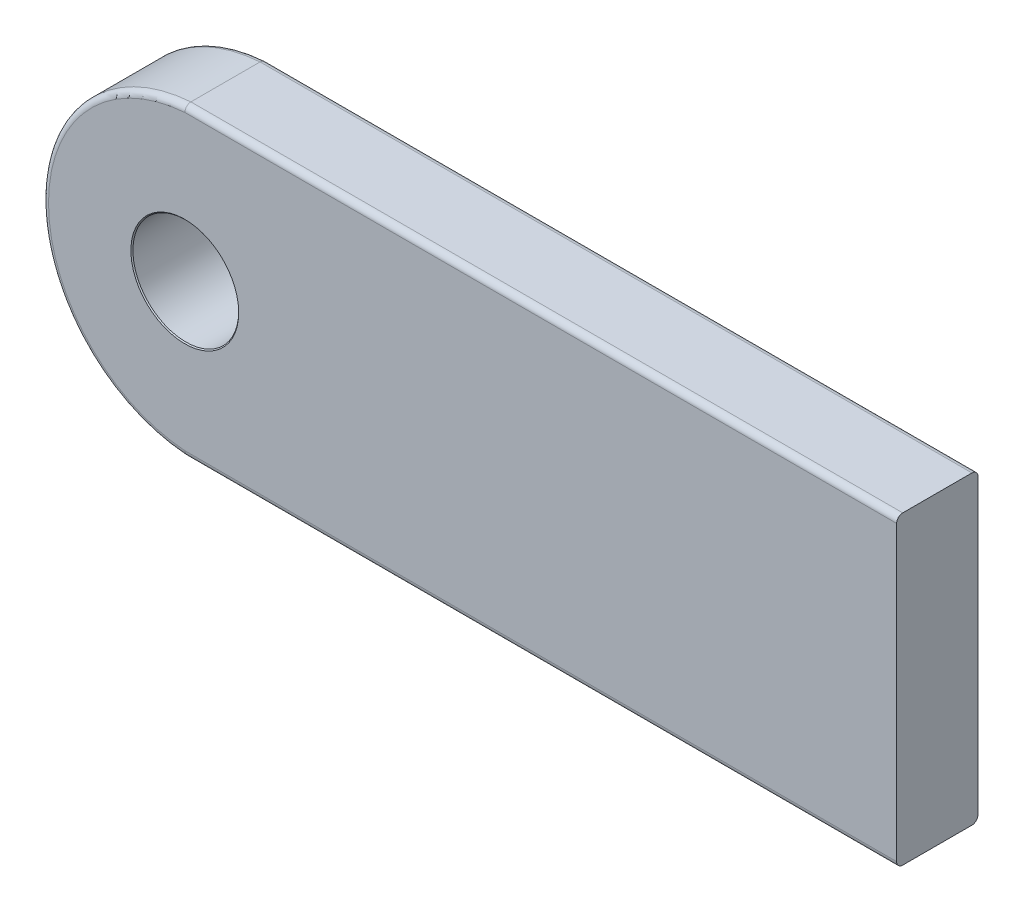
ISO-10303-21;
HEADER;
FILE_DESCRIPTION(('STEP AP214'),'2;1');
FILE_NAME('part.step','',(''),(''),'','','');
FILE_SCHEMA(('AUTOMOTIVE_DESIGN { 1 0 10303 214 1 1 1 1 }'));
ENDSEC;
DATA;
#1=APPLICATION_CONTEXT('core data for automotive mechanical design processes');
#2=APPLICATION_PROTOCOL_DEFINITION('international standard','automotive_design',2000,#1);
#3=PRODUCT_CONTEXT('',#1,'mechanical');
#4=PRODUCT('Part','Part','',(#3));
#5=PRODUCT_RELATED_PRODUCT_CATEGORY('part','',(#4));
#6=PRODUCT_DEFINITION_FORMATION('','',#4);
#7=PRODUCT_DEFINITION_CONTEXT('part definition',#1,'design');
#8=PRODUCT_DEFINITION('design','',#6,#7);
#9=PRODUCT_DEFINITION_SHAPE('','',#8);
#10=(LENGTH_UNIT() NAMED_UNIT(*) SI_UNIT(.MILLI.,.METRE.));
#11=(NAMED_UNIT(*) PLANE_ANGLE_UNIT() SI_UNIT($,.RADIAN.));
#12=(NAMED_UNIT(*) SI_UNIT($,.STERADIAN.) SOLID_ANGLE_UNIT());
#13=UNCERTAINTY_MEASURE_WITH_UNIT(LENGTH_MEASURE(1.E-05),#10,'distance_accuracy_value','');
#14=(GEOMETRIC_REPRESENTATION_CONTEXT(3) GLOBAL_UNCERTAINTY_ASSIGNED_CONTEXT((#13)) GLOBAL_UNIT_ASSIGNED_CONTEXT((#10,
#11,#12)) REPRESENTATION_CONTEXT('',''));
#15=CARTESIAN_POINT('',(0.,0.,0.));
#16=DIRECTION('',(0.,0.,1.));
#17=DIRECTION('',(1.,0.,0.));
#18=AXIS2_PLACEMENT_3D('',#15,#16,#17);
#19=CARTESIAN_POINT('',(-235.347698396897,0.,20.));
#20=DIRECTION('',(0.,0.,-1.));
#21=DIRECTION('',(-1.,0.,0.));
#22=AXIS2_PLACEMENT_3D('',#19,#20,#21);
#23=CYLINDRICAL_SURFACE('',#22,75.1785714285714);
#24=DIRECTION('',(0.,0.,-1.));
#25=VECTOR('',#24,1.);
#26=CARTESIAN_POINT('',(-240.526269825468,75.,20.));
#27=LINE('',#26,#25);
#28=CARTESIAN_POINT('',(-240.526269825468,75.,17.));
#29=VERTEX_POINT('',#28);
#30=CARTESIAN_POINT('',(-240.526269825468,75.,-17.));
#31=VERTEX_POINT('',#30);
#32=EDGE_CURVE('E271',#29,#31,#27,.T.);
#33=ORIENTED_EDGE('',*,*,#32,.T.);
#34=CARTESIAN_POINT('',(-235.347698396897,0.,-17.));
#35=DIRECTION('',(0.,0.,1.));
#36=DIRECTION('',(1.,0.,0.));
#37=AXIS2_PLACEMENT_3D('',#34,#35,#36);
#38=CIRCLE('',#37,75.1785714285714);
#39=CARTESIAN_POINT('',(-240.526269825468,-75.,-17.));
#40=VERTEX_POINT('',#39);
#41=EDGE_CURVE('E140',#31,#40,#38,.T.);
#42=ORIENTED_EDGE('',*,*,#41,.T.);
#43=DIRECTION('',(0.,0.,-1.));
#44=VECTOR('',#43,1.);
#45=CARTESIAN_POINT('',(-240.526269825468,-75.,20.));
#46=LINE('',#45,#44);
#47=CARTESIAN_POINT('',(-240.526269825468,-75.,17.));
#48=VERTEX_POINT('',#47);
#49=EDGE_CURVE('E118',#48,#40,#46,.T.);
#50=ORIENTED_EDGE('',*,*,#49,.F.);
#51=CARTESIAN_POINT('',(-235.347698396897,0.,17.));
#52=DIRECTION('',(0.,0.,1.));
#53=DIRECTION('',(1.,0.,0.));
#54=AXIS2_PLACEMENT_3D('',#51,#52,#53);
#55=CIRCLE('',#54,75.1785714285714);
#56=EDGE_CURVE('E138',#48,#29,#55,.F.);
#57=ORIENTED_EDGE('',*,*,#56,.T.);
#58=EDGE_LOOP('',(#33,#42,#50,#57));
#59=FACE_BOUND('',#58,.T.);
#60=ADVANCED_FACE('F33',(#59),#23,.T.);
#61=CARTESIAN_POINT('',(-240.526269825468,-75.,20.));
#62=DIRECTION('',(0.,1.,0.));
#63=DIRECTION('',(-1.,0.,0.));
#64=AXIS2_PLACEMENT_3D('',#61,#62,#63);
#65=PLANE('',#64);
#66=ORIENTED_EDGE('',*,*,#49,.T.);
#67=DIRECTION('',(1.,0.,0.));
#68=VECTOR('',#67,1.);
#69=CARTESIAN_POINT('',(-240.526269825468,-75.,-17.));
#70=LINE('',#69,#68);
#71=CARTESIAN_POINT('',(109.473730174532,-75.,-17.));
#72=VERTEX_POINT('',#71);
#73=EDGE_CURVE('E117',#40,#72,#70,.T.);
#74=ORIENTED_EDGE('',*,*,#73,.T.);
#75=DIRECTION('',(0.,0.,-1.));
#76=VECTOR('',#75,1.);
#77=CARTESIAN_POINT('',(109.473730174532,-75.,20.));
#78=LINE('',#77,#76);
#79=CARTESIAN_POINT('',(109.473730174532,-75.,17.));
#80=VERTEX_POINT('',#79);
#81=EDGE_CURVE('E102',#80,#72,#78,.T.);
#82=ORIENTED_EDGE('',*,*,#81,.F.);
#83=DIRECTION('',(1.,0.,0.));
#84=VECTOR('',#83,1.);
#85=CARTESIAN_POINT('',(-240.526269825468,-75.,17.));
#86=LINE('',#85,#84);
#87=EDGE_CURVE('E114',#80,#48,#86,.F.);
#88=ORIENTED_EDGE('',*,*,#87,.T.);
#89=EDGE_LOOP('',(#66,#74,#82,#88));
#90=FACE_BOUND('',#89,.T.);
#91=ADVANCED_FACE('F113',(#90),#65,.F.);
#92=CARTESIAN_POINT('',(109.473730174532,75.,20.));
#93=DIRECTION('',(1.,0.,0.));
#94=DIRECTION('',(0.,1.,0.));
#95=AXIS2_PLACEMENT_3D('',#92,#93,#94);
#96=PLANE('',#95);
#97=ORIENTED_EDGE('',*,*,#81,.T.);
#98=CARTESIAN_POINT('',(109.473730174532,-72.,-17.));
#99=DIRECTION('',(1.,0.,0.));
#100=DIRECTION('',(0.,1.,0.));
#101=AXIS2_PLACEMENT_3D('',#98,#99,#100);
#102=CIRCLE('',#101,3.);
#103=CARTESIAN_POINT('',(109.473730174532,-72.,-20.));
#104=VERTEX_POINT('',#103);
#105=EDGE_CURVE('E130',#72,#104,#102,.T.);
#106=ORIENTED_EDGE('',*,*,#105,.T.);
#107=DIRECTION('',(0.,-1.,0.));
#108=VECTOR('',#107,1.);
#109=CARTESIAN_POINT('',(109.473730174532,75.,-20.));
#110=LINE('',#109,#108);
#111=CARTESIAN_POINT('',(109.473730174532,72.,-20.));
#112=VERTEX_POINT('',#111);
#113=EDGE_CURVE('E254',#112,#104,#110,.T.);
#114=ORIENTED_EDGE('',*,*,#113,.F.);
#115=CARTESIAN_POINT('',(109.473730174532,72.,-17.));
#116=DIRECTION('',(1.,0.,0.));
#117=DIRECTION('',(0.,1.,0.));
#118=AXIS2_PLACEMENT_3D('',#115,#116,#117);
#119=CIRCLE('',#118,3.);
#120=CARTESIAN_POINT('',(109.473730174532,75.,-17.));
#121=VERTEX_POINT('',#120);
#122=EDGE_CURVE('E107',#112,#121,#119,.T.);
#123=ORIENTED_EDGE('',*,*,#122,.T.);
#124=DIRECTION('',(0.,0.,-1.));
#125=VECTOR('',#124,1.);
#126=CARTESIAN_POINT('',(109.473730174532,75.,20.));
#127=LINE('',#126,#125);
#128=CARTESIAN_POINT('',(109.473730174532,75.,17.));
#129=VERTEX_POINT('',#128);
#130=EDGE_CURVE('E119',#129,#121,#127,.T.);
#131=ORIENTED_EDGE('',*,*,#130,.F.);
#132=CARTESIAN_POINT('',(109.473730174532,72.,17.));
#133=DIRECTION('',(1.,0.,0.));
#134=DIRECTION('',(0.,1.,0.));
#135=AXIS2_PLACEMENT_3D('',#132,#133,#134);
#136=CIRCLE('',#135,3.);
#137=CARTESIAN_POINT('',(109.473730174532,72.,20.));
#138=VERTEX_POINT('',#137);
#139=EDGE_CURVE('E108',#129,#138,#136,.T.);
#140=ORIENTED_EDGE('',*,*,#139,.T.);
#141=DIRECTION('',(0.,-1.,0.));
#142=VECTOR('',#141,1.);
#143=CARTESIAN_POINT('',(109.473730174532,-39.9999999999999,20.));
#144=LINE('',#143,#142);
#145=CARTESIAN_POINT('',(109.473730174532,-72.,20.));
#146=VERTEX_POINT('',#145);
#147=EDGE_CURVE('E103',#138,#146,#144,.T.);
#148=ORIENTED_EDGE('',*,*,#147,.T.);
#149=CARTESIAN_POINT('',(109.473730174532,-72.,17.));
#150=DIRECTION('',(1.,0.,0.));
#151=DIRECTION('',(0.,1.,0.));
#152=AXIS2_PLACEMENT_3D('',#149,#150,#151);
#153=CIRCLE('',#152,3.);
#154=EDGE_CURVE('E99',#146,#80,#153,.T.);
#155=ORIENTED_EDGE('',*,*,#154,.T.);
#156=EDGE_LOOP('',(#97,#106,#114,#123,#131,#140,#148,#155));
#157=FACE_BOUND('',#156,.T.);
#158=ADVANCED_FACE('F101',(#157),#96,.T.);
#159=CARTESIAN_POINT('',(-240.526269825468,75.,20.));
#160=DIRECTION('',(0.,1.,0.));
#161=DIRECTION('',(-1.,0.,0.));
#162=AXIS2_PLACEMENT_3D('',#159,#160,#161);
#163=PLANE('',#162);
#164=ORIENTED_EDGE('',*,*,#130,.T.);
#165=DIRECTION('',(1.,0.,0.));
#166=VECTOR('',#165,1.);
#167=CARTESIAN_POINT('',(-240.526269825468,75.,-17.));
#168=LINE('',#167,#166);
#169=EDGE_CURVE('E144',#121,#31,#168,.F.);
#170=ORIENTED_EDGE('',*,*,#169,.T.);
#171=ORIENTED_EDGE('',*,*,#32,.F.);
#172=DIRECTION('',(1.,0.,0.));
#173=VECTOR('',#172,1.);
#174=CARTESIAN_POINT('',(-240.526269825468,75.,17.));
#175=LINE('',#174,#173);
#176=EDGE_CURVE('E142',#29,#129,#175,.T.);
#177=ORIENTED_EDGE('',*,*,#176,.T.);
#178=EDGE_LOOP('',(#164,#170,#171,#177));
#179=FACE_BOUND('',#178,.T.);
#180=ADVANCED_FACE('F226',(#179),#163,.T.);
#181=CARTESIAN_POINT('',(-235.347698396897,0.,20.));
#182=DIRECTION('',(0.,0.,1.));
#183=DIRECTION('',(1.,0.,0.));
#184=AXIS2_PLACEMENT_3D('',#181,#182,#183);
#185=PLANE('',#184);
#186=CARTESIAN_POINT('',(-240.526269825468,0.,20.));
#187=DIRECTION('',(0.,0.,1.));
#188=DIRECTION('',(1.,0.,0.));
#189=AXIS2_PLACEMENT_3D('',#186,#187,#188);
#190=CIRCLE('',#189,26.5000000000001);
#191=CARTESIAN_POINT('',(-214.026269825468,0.,20.));
#192=VERTEX_POINT('',#191);
#193=EDGE_CURVE('E41',#192,#192,#190,.F.);
#194=ORIENTED_EDGE('',*,*,#193,.T.);
#195=EDGE_LOOP('',(#194));
#196=FACE_BOUND('',#195,.T.);
#197=CARTESIAN_POINT('',(-235.347698396897,0.,20.));
#198=DIRECTION('',(0.,0.,1.));
#199=DIRECTION('',(1.,0.,0.));
#200=AXIS2_PLACEMENT_3D('',#197,#198,#199);
#201=CIRCLE('',#200,72.1785714285714);
#202=CARTESIAN_POINT('',(-240.42176712617,72.,20.));
#203=VERTEX_POINT('',#202);
#204=CARTESIAN_POINT('',(-240.42176712617,-72.,20.));
#205=VERTEX_POINT('',#204);
#206=EDGE_CURVE('E48',#203,#205,#201,.T.);
#207=ORIENTED_EDGE('',*,*,#206,.T.);
#208=DIRECTION('',(1.,0.,0.));
#209=VECTOR('',#208,1.);
#210=CARTESIAN_POINT('',(109.473730174532,-72.,20.));
#211=LINE('',#210,#209);
#212=EDGE_CURVE('E148',#205,#146,#211,.T.);
#213=ORIENTED_EDGE('',*,*,#212,.T.);
#214=ORIENTED_EDGE('',*,*,#147,.F.);
#215=DIRECTION('',(1.,0.,0.));
#216=VECTOR('',#215,1.);
#217=CARTESIAN_POINT('',(-235.347698396897,72.,20.));
#218=LINE('',#217,#216);
#219=EDGE_CURVE('E53',#138,#203,#218,.F.);
#220=ORIENTED_EDGE('',*,*,#219,.T.);
#221=EDGE_LOOP('',(#207,#213,#214,#220));
#222=FACE_BOUND('',#221,.T.);
#223=ADVANCED_FACE('F229',(#196,#222),#185,.T.);
#224=CARTESIAN_POINT('',(-235.347698396897,0.,-20.));
#225=DIRECTION('',(0.,0.,1.));
#226=DIRECTION('',(1.,0.,0.));
#227=AXIS2_PLACEMENT_3D('',#224,#225,#226);
#228=PLANE('',#227);
#229=CARTESIAN_POINT('',(-240.526269825468,0.,-20.));
#230=DIRECTION('',(0.,0.,1.));
#231=DIRECTION('',(1.,0.,0.));
#232=AXIS2_PLACEMENT_3D('',#229,#230,#231);
#233=CIRCLE('',#232,26.5);
#234=CARTESIAN_POINT('',(-214.026269825468,0.,-20.));
#235=VERTEX_POINT('',#234);
#236=EDGE_CURVE('E11',#235,#235,#233,.T.);
#237=ORIENTED_EDGE('',*,*,#236,.T.);
#238=EDGE_LOOP('',(#237));
#239=FACE_BOUND('',#238,.T.);
#240=ORIENTED_EDGE('',*,*,#113,.T.);
#241=DIRECTION('',(1.,0.,0.));
#242=VECTOR('',#241,1.);
#243=CARTESIAN_POINT('',(-235.347698396897,-72.,-20.));
#244=LINE('',#243,#242);
#245=CARTESIAN_POINT('',(-240.42176712617,-72.,-20.));
#246=VERTEX_POINT('',#245);
#247=EDGE_CURVE('E136',#104,#246,#244,.F.);
#248=ORIENTED_EDGE('',*,*,#247,.T.);
#249=CARTESIAN_POINT('',(-235.347698396897,0.,-20.));
#250=DIRECTION('',(0.,0.,1.));
#251=DIRECTION('',(1.,0.,0.));
#252=AXIS2_PLACEMENT_3D('',#249,#250,#251);
#253=CIRCLE('',#252,72.1785714285714);
#254=CARTESIAN_POINT('',(-240.42176712617,72.,-20.));
#255=VERTEX_POINT('',#254);
#256=EDGE_CURVE('E134',#246,#255,#253,.F.);
#257=ORIENTED_EDGE('',*,*,#256,.T.);
#258=DIRECTION('',(1.,0.,0.));
#259=VECTOR('',#258,1.);
#260=CARTESIAN_POINT('',(109.473730174532,72.,-20.));
#261=LINE('',#260,#259);
#262=EDGE_CURVE('E132',#255,#112,#261,.T.);
#263=ORIENTED_EDGE('',*,*,#262,.T.);
#264=EDGE_LOOP('',(#240,#248,#257,#263));
#265=FACE_BOUND('',#264,.T.);
#266=ADVANCED_FACE('F231',(#239,#265),#228,.F.);
#267=CARTESIAN_POINT('',(-240.526269825468,0.,-20.));
#268=DIRECTION('',(0.,0.,1.));
#269=DIRECTION('',(1.,0.,0.));
#270=AXIS2_PLACEMENT_3D('',#267,#268,#269);
#271=CYLINDRICAL_SURFACE('',#270,26.);
#272=CARTESIAN_POINT('',(-240.526269825468,0.,19.4999999999999));
#273=DIRECTION('',(0.,0.,1.));
#274=DIRECTION('',(1.,0.,0.));
#275=AXIS2_PLACEMENT_3D('',#272,#273,#274);
#276=CIRCLE('',#275,26.);
#277=CARTESIAN_POINT('',(-214.526269825468,0.,19.4999999999999));
#278=VERTEX_POINT('',#277);
#279=EDGE_CURVE('E245',#278,#278,#276,.T.);
#280=ORIENTED_EDGE('',*,*,#279,.T.);
#281=EDGE_LOOP('',(#280));
#282=FACE_BOUND('',#281,.T.);
#283=CARTESIAN_POINT('',(-240.526269825468,0.,-19.5));
#284=DIRECTION('',(0.,0.,1.));
#285=DIRECTION('',(1.,0.,0.));
#286=AXIS2_PLACEMENT_3D('',#283,#284,#285);
#287=CIRCLE('',#286,26.);
#288=CARTESIAN_POINT('',(-214.526269825468,0.,-19.5));
#289=VERTEX_POINT('',#288);
#290=EDGE_CURVE('E150',#289,#289,#287,.F.);
#291=ORIENTED_EDGE('',*,*,#290,.T.);
#292=EDGE_LOOP('',(#291));
#293=FACE_BOUND('',#292,.T.);
#294=ADVANCED_FACE('F180',(#282,#293),#271,.F.);
#295=CARTESIAN_POINT('',(-235.347698396897,72.,-17.));
#296=DIRECTION('',(-1.,0.,0.));
#297=DIRECTION('',(0.,-1.,0.));
#298=AXIS2_PLACEMENT_3D('',#295,#296,#297);
#299=CYLINDRICAL_SURFACE('',#298,3.);
#300=ORIENTED_EDGE('',*,*,#122,.F.);
#301=ORIENTED_EDGE('',*,*,#262,.F.);
#302=CARTESIAN_POINT('',(-240.526269825468,75.,-17.));
#303=CARTESIAN_POINT('',(-240.526270086808,75.0000081105018,-17.0843403762324));
#304=CARTESIAN_POINT('',(-240.526147182905,74.9964433810978,-17.1686769025316));
#305=CARTESIAN_POINT('',(-240.525657075799,74.982231001284,-17.3367463168199));
#306=CARTESIAN_POINT('',(-240.525289884568,74.9715836979767,-17.4204792341873));
#307=CARTESIAN_POINT('',(-240.524313577961,74.9432789007525,-17.5866952501968));
#308=CARTESIAN_POINT('',(-240.52370463336,74.9256263553472,-17.6691791885106));
#309=CARTESIAN_POINT('',(-240.522249513026,74.8834547291291,-17.8323456876527));
#310=CARTESIAN_POINT('',(-240.52140334013,74.8589357304252,-17.9130282700093));
#311=CARTESIAN_POINT('',(-240.51851536823,74.7752785524847,-18.15159403169));
#312=CARTESIAN_POINT('',(-240.51612370732,74.7060283277285,-18.306064517968));
#313=CARTESIAN_POINT('',(-240.510475792082,74.5426493248443,-18.6010617059232));
#314=CARTESIAN_POINT('',(-240.507219737396,74.4485262914001,-18.7415916170544));
#315=CARTESIAN_POINT('',(-240.49992899816,74.2380216318766,-19.0049092246905));
#316=CARTESIAN_POINT('',(-240.495894148546,74.121635287164,-19.1276931502914));
#317=CARTESIAN_POINT('',(-240.487154360085,73.8698822124317,-19.3520153284283));
#318=CARTESIAN_POINT('',(-240.482449199032,73.7345091886504,-19.4535465081104));
#319=CARTESIAN_POINT('',(-240.472495068058,73.4485594823376,-19.6325201330035));
#320=CARTESIAN_POINT('',(-240.46724564857,73.2979702336273,-19.7099424491923));
#321=CARTESIAN_POINT('',(-240.456352452373,72.9860011089153,-19.8383433213979));
#322=CARTESIAN_POINT('',(-240.450709019932,72.8246306581462,-19.8893446425445));
#323=CARTESIAN_POINT('',(-240.441390832835,72.5586458978824,-19.9493739520362));
#324=CARTESIAN_POINT('',(-240.437786843748,72.4558783527038,-19.9669925174396));
#325=CARTESIAN_POINT('',(-240.430529910677,72.2491709540441,-19.991438951325));
#326=CARTESIAN_POINT('',(-240.426877051646,72.1452331748097,-19.9982835769761));
#327=CARTESIAN_POINT('',(-240.422735793572,72.0275264363485,-19.9999054949833));
#328=CARTESIAN_POINT('',(-240.42225146945,72.0137624973552,-20.0000002489609));
#329=CARTESIAN_POINT('',(-240.42176712617,72.,-20.));
#330=B_SPLINE_CURVE_WITH_KNOTS('',3,(#302,#303,#304,#305,#306,#307,#308,#309,#310,#311,#312,
#313,#314,#315,#316,#317,#318,#319,#320,#321,#322,#323,#324,#325,#326,#327,#328,#329),
.UNSPECIFIED.,.F.,.F.,(4,2,2,2,2,2,2,2,2,2,2,2,2,4),(0.,0.252938792571035,0.505865190044811,
0.758613237141288,1.01135826200763,1.51664006331365,2.02180526536285,2.52707765433434,
3.03251793012337,3.53837908462443,4.04380364583137,4.35630968056994,4.66832917934075,
4.70964599695255),.UNSPECIFIED.);
#331=EDGE_CURVE('E160',#31,#255,#330,.T.);
#332=ORIENTED_EDGE('',*,*,#331,.F.);
#333=ORIENTED_EDGE('',*,*,#169,.F.);
#334=EDGE_LOOP('',(#300,#301,#332,#333));
#335=FACE_BOUND('',#334,.T.);
#336=ADVANCED_FACE('F174',(#335),#299,.T.);
#337=CARTESIAN_POINT('',(-235.347698396897,0.,-17.));
#338=DIRECTION('',(0.,0.,1.));
#339=DIRECTION('',(1.,0.,0.));
#340=AXIS2_PLACEMENT_3D('',#337,#338,#339);
#341=TOROIDAL_SURFACE('',#340,72.1785714285714,3.);
#342=ORIENTED_EDGE('',*,*,#331,.T.);
#343=ORIENTED_EDGE('',*,*,#256,.F.);
#344=CARTESIAN_POINT('',(-240.526269825468,-75.,-17.));
#345=CARTESIAN_POINT('',(-240.526270086808,-75.0000081105017,-17.0843403762324));
#346=CARTESIAN_POINT('',(-240.526147182905,-74.9964433810978,-17.1686769025316));
#347=CARTESIAN_POINT('',(-240.525657075799,-74.982231001284,-17.3367463168199));
#348=CARTESIAN_POINT('',(-240.525289884568,-74.9715836979766,-17.4204792341873));
#349=CARTESIAN_POINT('',(-240.524313577961,-74.9432789007525,-17.5866952501968));
#350=CARTESIAN_POINT('',(-240.52370463336,-74.9256263553472,-17.6691791885106));
#351=CARTESIAN_POINT('',(-240.522249513026,-74.8834547291291,-17.8323456876527));
#352=CARTESIAN_POINT('',(-240.52140334013,-74.8589357304252,-17.9130282700093));
#353=CARTESIAN_POINT('',(-240.51851536823,-74.7752785524847,-18.15159403169));
#354=CARTESIAN_POINT('',(-240.51612370732,-74.7060283277284,-18.306064517968));
#355=CARTESIAN_POINT('',(-240.510475792082,-74.5426493248443,-18.6010617059232));
#356=CARTESIAN_POINT('',(-240.507219737396,-74.4485262914,-18.7415916170544));
#357=CARTESIAN_POINT('',(-240.49992899816,-74.2380216318766,-19.0049092246905));
#358=CARTESIAN_POINT('',(-240.495894148546,-74.121635287164,-19.1276931502914));
#359=CARTESIAN_POINT('',(-240.487154360085,-73.8698822124317,-19.3520153284283));
#360=CARTESIAN_POINT('',(-240.482449199032,-73.7345091886503,-19.4535465081104));
#361=CARTESIAN_POINT('',(-240.472495068058,-73.4485594823375,-19.6325201330035));
#362=CARTESIAN_POINT('',(-240.46724564857,-73.2979702336273,-19.7099424491923));
#363=CARTESIAN_POINT('',(-240.456352452373,-72.9860011089153,-19.8383433213979));
#364=CARTESIAN_POINT('',(-240.450709019931,-72.8246306581462,-19.8893446425445));
#365=CARTESIAN_POINT('',(-240.441390832836,-72.5586458978823,-19.9493739520362));
#366=CARTESIAN_POINT('',(-240.43778684375,-72.4558783527037,-19.9669925174396));
#367=CARTESIAN_POINT('',(-240.430529910674,-72.2491709540442,-19.9914389513251));
#368=CARTESIAN_POINT('',(-240.426877051636,-72.14523317481,-19.9982835769761));
#369=CARTESIAN_POINT('',(-240.42273579357,-72.0275264363485,-19.9999054949833));
#370=CARTESIAN_POINT('',(-240.422251469448,-72.0137624973552,-20.0000002489609));
#371=CARTESIAN_POINT('',(-240.42176712617,-72.,-20.));
#372=B_SPLINE_CURVE_WITH_KNOTS('',3,(#344,#345,#346,#347,#348,#349,#350,#351,#352,#353,#354,
#355,#356,#357,#358,#359,#360,#361,#362,#363,#364,#365,#366,#367,#368,#369,#370,#371),
.UNSPECIFIED.,.F.,.F.,(4,2,2,2,2,2,2,2,2,2,2,2,2,4),(0.,0.252938792571038,0.505865190044815,
0.758613237141291,1.01135826200763,1.51664006331365,2.02180526536285,2.52707765433435,
3.03251793012338,3.53837908462443,4.04380364583136,4.35630968056992,4.66832917934077,
4.70964599695256),.UNSPECIFIED.);
#373=EDGE_CURVE('E151',#40,#246,#372,.T.);
#374=ORIENTED_EDGE('',*,*,#373,.F.);
#375=ORIENTED_EDGE('',*,*,#41,.F.);
#376=EDGE_LOOP('',(#342,#343,#374,#375));
#377=FACE_BOUND('',#376,.T.);
#378=ADVANCED_FACE('F171',(#377),#341,.T.);
#379=CARTESIAN_POINT('',(-240.526269825468,-72.,-17.));
#380=DIRECTION('',(1.,0.,0.));
#381=DIRECTION('',(0.,1.,0.));
#382=AXIS2_PLACEMENT_3D('',#379,#380,#381);
#383=CYLINDRICAL_SURFACE('',#382,3.);
#384=ORIENTED_EDGE('',*,*,#373,.T.);
#385=ORIENTED_EDGE('',*,*,#247,.F.);
#386=ORIENTED_EDGE('',*,*,#105,.F.);
#387=ORIENTED_EDGE('',*,*,#73,.F.);
#388=EDGE_LOOP('',(#384,#385,#386,#387));
#389=FACE_BOUND('',#388,.T.);
#390=ADVANCED_FACE('F168',(#389),#383,.T.);
#391=CARTESIAN_POINT('',(-240.526269825468,72.,17.));
#392=DIRECTION('',(1.,0.,0.));
#393=DIRECTION('',(0.,1.,0.));
#394=AXIS2_PLACEMENT_3D('',#391,#392,#393);
#395=CYLINDRICAL_SURFACE('',#394,3.);
#396=ORIENTED_EDGE('',*,*,#139,.F.);
#397=ORIENTED_EDGE('',*,*,#176,.F.);
#398=CARTESIAN_POINT('',(-240.526269825468,75.,17.));
#399=CARTESIAN_POINT('',(-240.526270086808,75.0000081105018,17.0843403762324));
#400=CARTESIAN_POINT('',(-240.526147182905,74.9964433810978,17.1686769025316));
#401=CARTESIAN_POINT('',(-240.525657075799,74.982231001284,17.3367463168199));
#402=CARTESIAN_POINT('',(-240.525289884568,74.9715836979767,17.4204792341873));
#403=CARTESIAN_POINT('',(-240.524313577961,74.9432789007525,17.5866952501968));
#404=CARTESIAN_POINT('',(-240.52370463336,74.9256263553472,17.6691791885106));
#405=CARTESIAN_POINT('',(-240.522249513026,74.8834547291291,17.8323456876527));
#406=CARTESIAN_POINT('',(-240.52140334013,74.8589357304252,17.9130282700093));
#407=CARTESIAN_POINT('',(-240.51851536823,74.7752785524847,18.15159403169));
#408=CARTESIAN_POINT('',(-240.51612370732,74.7060283277285,18.306064517968));
#409=CARTESIAN_POINT('',(-240.510475792082,74.5426493248443,18.6010617059232));
#410=CARTESIAN_POINT('',(-240.507219737396,74.4485262914001,18.7415916170544));
#411=CARTESIAN_POINT('',(-240.49992899816,74.2380216318766,19.0049092246905));
#412=CARTESIAN_POINT('',(-240.495894148546,74.121635287164,19.1276931502914));
#413=CARTESIAN_POINT('',(-240.487154360085,73.8698822124317,19.3520153284283));
#414=CARTESIAN_POINT('',(-240.482449199032,73.7345091886504,19.4535465081104));
#415=CARTESIAN_POINT('',(-240.472495068058,73.4485594823376,19.6325201330035));
#416=CARTESIAN_POINT('',(-240.46724564857,73.2979702336273,19.7099424491923));
#417=CARTESIAN_POINT('',(-240.456352452373,72.9860011089153,19.8383433213979));
#418=CARTESIAN_POINT('',(-240.450709019931,72.8246306581462,19.8893446425445));
#419=CARTESIAN_POINT('',(-240.441390832836,72.5586458978824,19.9493739520362));
#420=CARTESIAN_POINT('',(-240.43778684375,72.4558783527037,19.9669925174396));
#421=CARTESIAN_POINT('',(-240.430529910674,72.2491709540443,19.991438951325));
#422=CARTESIAN_POINT('',(-240.426877051636,72.14523317481,19.9982835769761));
#423=CARTESIAN_POINT('',(-240.42273579357,72.0275264363486,19.9999054949833));
#424=CARTESIAN_POINT('',(-240.422251469448,72.0137624973553,20.0000002489609));
#425=CARTESIAN_POINT('',(-240.42176712617,72.,20.));
#426=B_SPLINE_CURVE_WITH_KNOTS('',3,(#398,#399,#400,#401,#402,#403,#404,#405,#406,#407,#408,
#409,#410,#411,#412,#413,#414,#415,#416,#417,#418,#419,#420,#421,#422,#423,#424,#425),
.UNSPECIFIED.,.F.,.F.,(4,2,2,2,2,2,2,2,2,2,2,2,2,4),(0.,0.252938792571042,0.505865190044814,
0.758613237141291,1.01135826200762,1.51664006331364,2.02180526536285,2.52707765433435,
3.03251793012338,3.53837908462443,4.04380364583137,4.35630968056992,4.66832917934077,
4.70964599695256),.UNSPECIFIED.);
#427=EDGE_CURVE('E161',#203,#29,#426,.F.);
#428=ORIENTED_EDGE('',*,*,#427,.F.);
#429=ORIENTED_EDGE('',*,*,#219,.F.);
#430=EDGE_LOOP('',(#396,#397,#428,#429));
#431=FACE_BOUND('',#430,.T.);
#432=ADVANCED_FACE('F186',(#431),#395,.T.);
#433=CARTESIAN_POINT('',(-235.347698396897,0.,17.));
#434=DIRECTION('',(0.,0.,1.));
#435=DIRECTION('',(1.,0.,0.));
#436=AXIS2_PLACEMENT_3D('',#433,#434,#435);
#437=TOROIDAL_SURFACE('',#436,72.1785714285714,3.);
#438=ORIENTED_EDGE('',*,*,#427,.T.);
#439=ORIENTED_EDGE('',*,*,#56,.F.);
#440=CARTESIAN_POINT('',(-240.526269825468,-75.,17.));
#441=CARTESIAN_POINT('',(-240.526270086808,-75.0000081105017,17.0843403762324));
#442=CARTESIAN_POINT('',(-240.526147182905,-74.9964433810978,17.1686769025316));
#443=CARTESIAN_POINT('',(-240.525657075799,-74.982231001284,17.3367463168199));
#444=CARTESIAN_POINT('',(-240.525289884568,-74.9715836979766,17.4204792341873));
#445=CARTESIAN_POINT('',(-240.524313577961,-74.9432789007525,17.5866952501968));
#446=CARTESIAN_POINT('',(-240.52370463336,-74.9256263553472,17.6691791885106));
#447=CARTESIAN_POINT('',(-240.522249513026,-74.8834547291291,17.8323456876527));
#448=CARTESIAN_POINT('',(-240.52140334013,-74.8589357304252,17.9130282700093));
#449=CARTESIAN_POINT('',(-240.51851536823,-74.7752785524847,18.15159403169));
#450=CARTESIAN_POINT('',(-240.51612370732,-74.7060283277284,18.306064517968));
#451=CARTESIAN_POINT('',(-240.510475792082,-74.5426493248443,18.6010617059232));
#452=CARTESIAN_POINT('',(-240.507219737396,-74.4485262914,18.7415916170544));
#453=CARTESIAN_POINT('',(-240.49992899816,-74.2380216318766,19.0049092246905));
#454=CARTESIAN_POINT('',(-240.495894148546,-74.121635287164,19.1276931502914));
#455=CARTESIAN_POINT('',(-240.487154360084,-73.8698822124317,19.3520153284283));
#456=CARTESIAN_POINT('',(-240.482449199032,-73.7345091886503,19.4535465081104));
#457=CARTESIAN_POINT('',(-240.472495068058,-73.4485594823375,19.6325201330035));
#458=CARTESIAN_POINT('',(-240.46724564857,-73.2979702336273,19.7099424491923));
#459=CARTESIAN_POINT('',(-240.456352452373,-72.9860011089153,19.8383433213979));
#460=CARTESIAN_POINT('',(-240.450709019931,-72.8246306581462,19.8893446425445));
#461=CARTESIAN_POINT('',(-240.441390832836,-72.5586458978823,19.9493739520362));
#462=CARTESIAN_POINT('',(-240.43778684375,-72.4558783527037,19.9669925174396));
#463=CARTESIAN_POINT('',(-240.430529910674,-72.2491709540442,19.991438951325));
#464=CARTESIAN_POINT('',(-240.426877051636,-72.14523317481,19.9982835769761));
#465=CARTESIAN_POINT('',(-240.42273579357,-72.0275264363485,19.9999054949833));
#466=CARTESIAN_POINT('',(-240.422251469448,-72.0137624973552,20.0000002489609));
#467=CARTESIAN_POINT('',(-240.42176712617,-72.,20.));
#468=B_SPLINE_CURVE_WITH_KNOTS('',3,(#440,#441,#442,#443,#444,#445,#446,#447,#448,#449,#450,
#451,#452,#453,#454,#455,#456,#457,#458,#459,#460,#461,#462,#463,#464,#465,#466,#467),
.UNSPECIFIED.,.F.,.F.,(4,2,2,2,2,2,2,2,2,2,2,2,2,4),(0.,0.252938792571042,0.505865190044814,
0.758613237141291,1.01135826200762,1.51664006331364,2.02180526536285,2.52707765433435,
3.03251793012338,3.53837908462443,4.04380364583137,4.35630968056992,4.66832917934077,
4.70964599695256),.UNSPECIFIED.);
#469=EDGE_CURVE('E123',#205,#48,#468,.F.);
#470=ORIENTED_EDGE('',*,*,#469,.F.);
#471=ORIENTED_EDGE('',*,*,#206,.F.);
#472=EDGE_LOOP('',(#438,#439,#470,#471));
#473=FACE_BOUND('',#472,.T.);
#474=ADVANCED_FACE('F182',(#473),#437,.T.);
#475=CARTESIAN_POINT('',(-235.347698396897,-72.,17.));
#476=DIRECTION('',(-1.,0.,0.));
#477=DIRECTION('',(0.,-1.,0.));
#478=AXIS2_PLACEMENT_3D('',#475,#476,#477);
#479=CYLINDRICAL_SURFACE('',#478,3.);
#480=ORIENTED_EDGE('',*,*,#469,.T.);
#481=ORIENTED_EDGE('',*,*,#87,.F.);
#482=ORIENTED_EDGE('',*,*,#154,.F.);
#483=ORIENTED_EDGE('',*,*,#212,.F.);
#484=EDGE_LOOP('',(#480,#481,#482,#483));
#485=FACE_BOUND('',#484,.T.);
#486=ADVANCED_FACE('F122',(#485),#479,.T.);
#487=CARTESIAN_POINT('',(-240.526269825468,0.,19.4999999999999));
#488=DIRECTION('',(0.,0.,1.));
#489=DIRECTION('',(1.,0.,0.));
#490=AXIS2_PLACEMENT_3D('',#487,#488,#489);
#491=CONICAL_SURFACE('',#490,26.,0.785398163397455);
#492=ORIENTED_EDGE('',*,*,#193,.F.);
#493=EDGE_LOOP('',(#492));
#494=FACE_BOUND('',#493,.T.);
#495=ORIENTED_EDGE('',*,*,#279,.F.);
#496=EDGE_LOOP('',(#495));
#497=FACE_BOUND('',#496,.T.);
#498=ADVANCED_FACE('F206',(#494,#497),#491,.F.);
#499=CARTESIAN_POINT('',(-240.526269825468,0.,-20.));
#500=DIRECTION('',(0.,0.,-1.));
#501=DIRECTION('',(-1.,0.,0.));
#502=AXIS2_PLACEMENT_3D('',#499,#500,#501);
#503=CONICAL_SURFACE('',#502,26.5,0.785398163397473);
#504=ORIENTED_EDGE('',*,*,#290,.F.);
#505=EDGE_LOOP('',(#504));
#506=FACE_BOUND('',#505,.T.);
#507=ORIENTED_EDGE('',*,*,#236,.F.);
#508=EDGE_LOOP('',(#507));
#509=FACE_BOUND('',#508,.T.);
#510=ADVANCED_FACE('F35',(#506,#509),#503,.F.);
#511=CLOSED_SHELL('',(#60,#91,#158,#180,#223,#266,#294,#336,#378,#390,#432,#474,#486,#498,#510));
#512=MANIFOLD_SOLID_BREP('B2',#511);
#513=ADVANCED_BREP_SHAPE_REPRESENTATION('',(#18,#512),#14);
#514=SHAPE_DEFINITION_REPRESENTATION(#9,#513);
ENDSEC;
END-ISO-10303-21;
